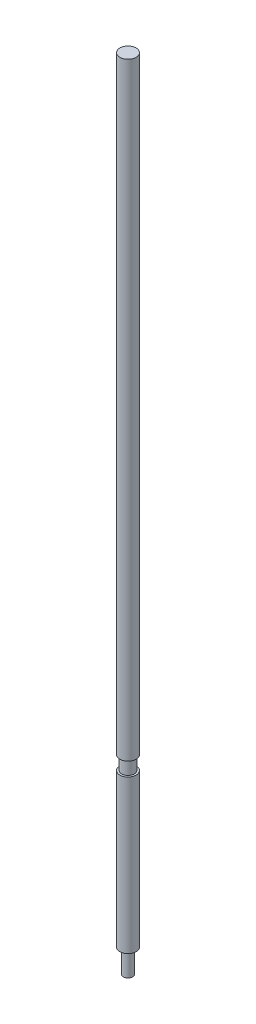
ISO-10303-21;
HEADER;
FILE_DESCRIPTION(('STEP AP214'),'2;1');
FILE_NAME('part.step','',(''),(''),'','','');
FILE_SCHEMA(('AUTOMOTIVE_DESIGN { 1 0 10303 214 1 1 1 1 }'));
ENDSEC;
DATA;
#1=APPLICATION_CONTEXT('core data for automotive mechanical design processes');
#2=APPLICATION_PROTOCOL_DEFINITION('international standard','automotive_design',2000,#1);
#3=PRODUCT_CONTEXT('',#1,'mechanical');
#4=PRODUCT('Part','Part','',(#3));
#5=PRODUCT_RELATED_PRODUCT_CATEGORY('part','',(#4));
#6=PRODUCT_DEFINITION_FORMATION('','',#4);
#7=PRODUCT_DEFINITION_CONTEXT('part definition',#1,'design');
#8=PRODUCT_DEFINITION('design','',#6,#7);
#9=PRODUCT_DEFINITION_SHAPE('','',#8);
#10=(LENGTH_UNIT() NAMED_UNIT(*) SI_UNIT(.MILLI.,.METRE.));
#11=(NAMED_UNIT(*) PLANE_ANGLE_UNIT() SI_UNIT($,.RADIAN.));
#12=(NAMED_UNIT(*) SI_UNIT($,.STERADIAN.) SOLID_ANGLE_UNIT());
#13=UNCERTAINTY_MEASURE_WITH_UNIT(LENGTH_MEASURE(1.E-05),#10,'distance_accuracy_value','');
#14=(GEOMETRIC_REPRESENTATION_CONTEXT(3) GLOBAL_UNCERTAINTY_ASSIGNED_CONTEXT((#13)) GLOBAL_UNIT_ASSIGNED_CONTEXT((#10,
#11,#12)) REPRESENTATION_CONTEXT('',''));
#15=CARTESIAN_POINT('',(0.,0.,0.));
#16=DIRECTION('',(0.,0.,1.));
#17=DIRECTION('',(1.,0.,0.));
#18=AXIS2_PLACEMENT_3D('',#15,#16,#17);
#19=CARTESIAN_POINT('',(0.,290.401302325581,0.));
#20=DIRECTION('',(0.,1.,0.));
#21=DIRECTION('',(0.,0.,1.));
#22=AXIS2_PLACEMENT_3D('',#19,#20,#21);
#23=PLANE('',#22);
#24=CARTESIAN_POINT('',(0.,290.401302325581,0.));
#25=DIRECTION('',(0.,1.,0.));
#26=DIRECTION('',(0.,0.,1.));
#27=AXIS2_PLACEMENT_3D('',#24,#25,#26);
#28=CIRCLE('',#27,4.14000000000003);
#29=CARTESIAN_POINT('',(0.,290.401302325581,4.14000000000003));
#30=VERTEX_POINT('',#29);
#31=EDGE_CURVE('E10',#30,#30,#28,.T.);
#32=ORIENTED_EDGE('',*,*,#31,.T.);
#33=EDGE_LOOP('',(#32));
#34=FACE_BOUND('',#33,.T.);
#35=ADVANCED_FACE('F36',(#34),#23,.T.);
#36=CARTESIAN_POINT('',(0.,19.9200486396109,0.));
#37=DIRECTION('',(0.,1.,0.));
#38=DIRECTION('',(0.,0.,1.));
#39=AXIS2_PLACEMENT_3D('',#36,#37,#38);
#40=CYLINDRICAL_SURFACE('',#39,4.14000000000001);
#41=CARTESIAN_POINT('',(0.,-19.5986976744186,0.));
#42=DIRECTION('',(0.,1.,0.));
#43=DIRECTION('',(0.,0.,1.));
#44=AXIS2_PLACEMENT_3D('',#41,#42,#43);
#45=CIRCLE('',#44,4.13999999999999);
#46=CARTESIAN_POINT('',(0.,-19.5986976744186,4.13999999999999));
#47=VERTEX_POINT('',#46);
#48=EDGE_CURVE('E42',#47,#47,#45,.T.);
#49=ORIENTED_EDGE('',*,*,#48,.T.);
#50=EDGE_LOOP('',(#49));
#51=FACE_BOUND('',#50,.T.);
#52=ORIENTED_EDGE('',*,*,#31,.F.);
#53=EDGE_LOOP('',(#52));
#54=FACE_BOUND('',#53,.T.);
#55=ADVANCED_FACE('F80',(#51,#54),#40,.T.);
#56=CARTESIAN_POINT('',(-4.13999999999999,-19.5986976744186,0.));
#57=DIRECTION('',(0.,-1.,0.));
#58=DIRECTION('',(0.,0.,-1.));
#59=AXIS2_PLACEMENT_3D('',#56,#57,#58);
#60=PLANE('',#59);
#61=CARTESIAN_POINT('',(0.,-19.5986976744186,0.));
#62=DIRECTION('',(0.,1.,0.));
#63=DIRECTION('',(0.,0.,1.));
#64=AXIS2_PLACEMENT_3D('',#61,#62,#63);
#65=CIRCLE('',#64,3.18499999999999);
#66=CARTESIAN_POINT('',(0.,-19.5986976744186,3.18499999999999));
#67=VERTEX_POINT('',#66);
#68=EDGE_CURVE('E46',#67,#67,#65,.T.);
#69=ORIENTED_EDGE('',*,*,#68,.T.);
#70=EDGE_LOOP('',(#69));
#71=FACE_BOUND('',#70,.T.);
#72=ORIENTED_EDGE('',*,*,#48,.F.);
#73=EDGE_LOOP('',(#72));
#74=FACE_BOUND('',#73,.T.);
#75=ADVANCED_FACE('F84',(#71,#74),#60,.T.);
#76=CARTESIAN_POINT('',(0.,19.9200486396109,0.));
#77=DIRECTION('',(0.,1.,0.));
#78=DIRECTION('',(0.,0.,1.));
#79=AXIS2_PLACEMENT_3D('',#76,#77,#78);
#80=CYLINDRICAL_SURFACE('',#79,3.18499999999999);
#81=CARTESIAN_POINT('',(0.,-26.5986976744186,0.));
#82=DIRECTION('',(0.,1.,0.));
#83=DIRECTION('',(0.,0.,1.));
#84=AXIS2_PLACEMENT_3D('',#81,#82,#83);
#85=CIRCLE('',#84,3.18499999999999);
#86=CARTESIAN_POINT('',(0.,-26.5986976744186,3.18499999999999));
#87=VERTEX_POINT('',#86);
#88=EDGE_CURVE('E50',#87,#87,#85,.T.);
#89=ORIENTED_EDGE('',*,*,#88,.T.);
#90=EDGE_LOOP('',(#89));
#91=FACE_BOUND('',#90,.T.);
#92=ORIENTED_EDGE('',*,*,#68,.F.);
#93=EDGE_LOOP('',(#92));
#94=FACE_BOUND('',#93,.T.);
#95=ADVANCED_FACE('F88',(#91,#94),#80,.T.);
#96=CARTESIAN_POINT('',(-3.18499999999999,-26.5986976744186,0.));
#97=DIRECTION('',(0.,1.,0.));
#98=DIRECTION('',(0.,0.,1.));
#99=AXIS2_PLACEMENT_3D('',#96,#97,#98);
#100=PLANE('',#99);
#101=CARTESIAN_POINT('',(0.,-26.5986976744186,0.));
#102=DIRECTION('',(0.,1.,0.));
#103=DIRECTION('',(0.,0.,1.));
#104=AXIS2_PLACEMENT_3D('',#101,#102,#103);
#105=CIRCLE('',#104,4.13999999999999);
#106=CARTESIAN_POINT('',(0.,-26.5986976744186,4.13999999999999));
#107=VERTEX_POINT('',#106);
#108=EDGE_CURVE('E55',#107,#107,#105,.T.);
#109=ORIENTED_EDGE('',*,*,#108,.T.);
#110=EDGE_LOOP('',(#109));
#111=FACE_BOUND('',#110,.T.);
#112=ORIENTED_EDGE('',*,*,#88,.F.);
#113=EDGE_LOOP('',(#112));
#114=FACE_BOUND('',#113,.T.);
#115=ADVANCED_FACE('F95',(#111,#114),#100,.T.);
#116=CARTESIAN_POINT('',(0.,19.9200486396109,0.));
#117=DIRECTION('',(0.,1.,0.));
#118=DIRECTION('',(0.,0.,1.));
#119=AXIS2_PLACEMENT_3D('',#116,#117,#118);
#120=CYLINDRICAL_SURFACE('',#119,4.13999999999999);
#121=CARTESIAN_POINT('',(0.,-104.598697674419,0.));
#122=DIRECTION('',(0.,1.,0.));
#123=DIRECTION('',(0.,0.,1.));
#124=AXIS2_PLACEMENT_3D('',#121,#122,#123);
#125=CIRCLE('',#124,4.13999999999998);
#126=CARTESIAN_POINT('',(0.,-104.598697674419,4.13999999999998));
#127=VERTEX_POINT('',#126);
#128=EDGE_CURVE('E58',#127,#127,#125,.T.);
#129=ORIENTED_EDGE('',*,*,#128,.T.);
#130=EDGE_LOOP('',(#129));
#131=FACE_BOUND('',#130,.T.);
#132=ORIENTED_EDGE('',*,*,#108,.F.);
#133=EDGE_LOOP('',(#132));
#134=FACE_BOUND('',#133,.T.);
#135=ADVANCED_FACE('F99',(#131,#134),#120,.T.);
#136=CARTESIAN_POINT('',(-4.13999999999998,-104.598697674419,0.));
#137=DIRECTION('',(0.,-1.,0.));
#138=DIRECTION('',(0.,0.,-1.));
#139=AXIS2_PLACEMENT_3D('',#136,#137,#138);
#140=PLANE('',#139);
#141=CARTESIAN_POINT('',(0.,-104.598697674419,0.));
#142=DIRECTION('',(0.,1.,0.));
#143=DIRECTION('',(0.,0.,1.));
#144=AXIS2_PLACEMENT_3D('',#141,#142,#143);
#145=CIRCLE('',#144,2.38499999999998);
#146=CARTESIAN_POINT('',(0.,-104.598697674419,2.38499999999998));
#147=VERTEX_POINT('',#146);
#148=EDGE_CURVE('E61',#147,#147,#145,.T.);
#149=ORIENTED_EDGE('',*,*,#148,.T.);
#150=EDGE_LOOP('',(#149));
#151=FACE_BOUND('',#150,.T.);
#152=ORIENTED_EDGE('',*,*,#128,.F.);
#153=EDGE_LOOP('',(#152));
#154=FACE_BOUND('',#153,.T.);
#155=ADVANCED_FACE('F77',(#151,#154),#140,.T.);
#156=CARTESIAN_POINT('',(0.,19.9200486396109,0.));
#157=DIRECTION('',(0.,1.,0.));
#158=DIRECTION('',(0.,0.,1.));
#159=AXIS2_PLACEMENT_3D('',#156,#157,#158);
#160=CYLINDRICAL_SURFACE('',#159,2.38499999999998);
#161=CARTESIAN_POINT('',(0.,-116.598697674419,0.));
#162=DIRECTION('',(0.,1.,0.));
#163=DIRECTION('',(0.,0.,1.));
#164=AXIS2_PLACEMENT_3D('',#161,#162,#163);
#165=CIRCLE('',#164,2.38499999999998);
#166=CARTESIAN_POINT('',(0.,-116.598697674419,2.38499999999998));
#167=VERTEX_POINT('',#166);
#168=EDGE_CURVE('E64',#167,#167,#165,.T.);
#169=ORIENTED_EDGE('',*,*,#168,.T.);
#170=EDGE_LOOP('',(#169));
#171=FACE_BOUND('',#170,.T.);
#172=ORIENTED_EDGE('',*,*,#148,.F.);
#173=EDGE_LOOP('',(#172));
#174=FACE_BOUND('',#173,.T.);
#175=ADVANCED_FACE('F68',(#171,#174),#160,.T.);
#176=CARTESIAN_POINT('',(-2.38499999999998,-116.598697674419,0.));
#177=DIRECTION('',(0.,-1.,0.));
#178=DIRECTION('',(0.,0.,-1.));
#179=AXIS2_PLACEMENT_3D('',#176,#177,#178);
#180=PLANE('',#179);
#181=ORIENTED_EDGE('',*,*,#168,.F.);
#182=EDGE_LOOP('',(#181));
#183=FACE_BOUND('',#182,.T.);
#184=ADVANCED_FACE('F71',(#183),#180,.T.);
#185=CLOSED_SHELL('',(#35,#55,#75,#95,#115,#135,#155,#175,#184));
#186=MANIFOLD_SOLID_BREP('B2',#185);
#187=ADVANCED_BREP_SHAPE_REPRESENTATION('',(#18,#186),#14);
#188=SHAPE_DEFINITION_REPRESENTATION(#9,#187);
ENDSEC;
END-ISO-10303-21;
